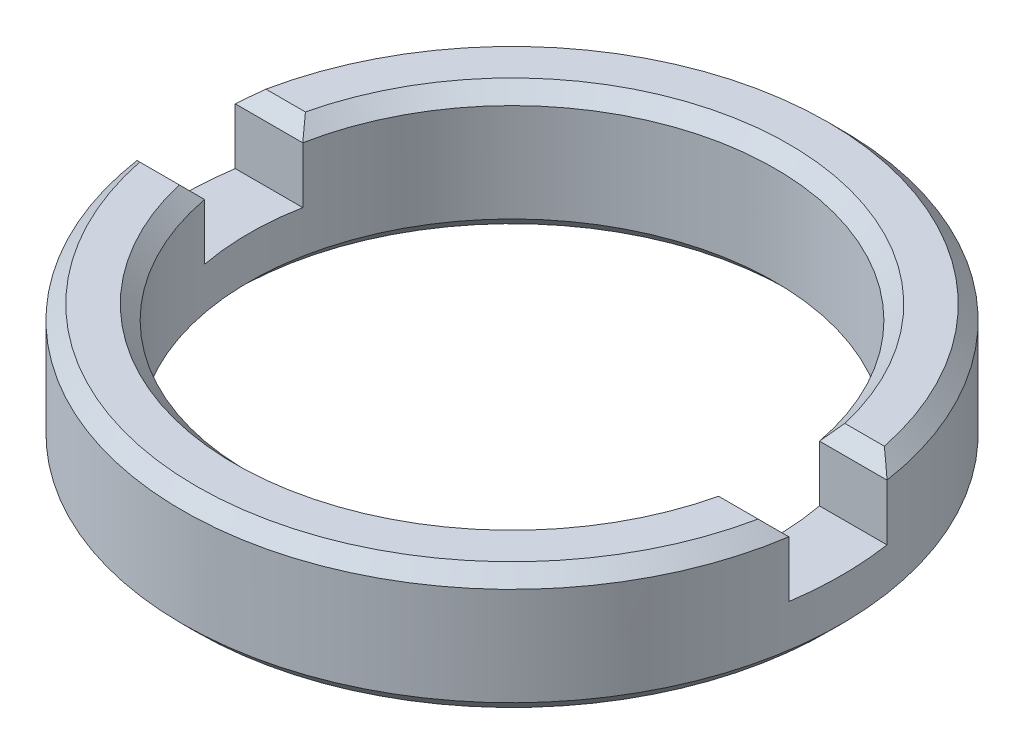
ISO-10303-21;
HEADER;
FILE_DESCRIPTION(('STEP AP214'),'2;1');
FILE_NAME('part.step','',(''),(''),'','','');
FILE_SCHEMA(('AUTOMOTIVE_DESIGN { 1 0 10303 214 1 1 1 1 }'));
ENDSEC;
DATA;
#1=APPLICATION_CONTEXT('core data for automotive mechanical design processes');
#2=APPLICATION_PROTOCOL_DEFINITION('international standard','automotive_design',2000,#1);
#3=PRODUCT_CONTEXT('',#1,'mechanical');
#4=PRODUCT('Part','Part','',(#3));
#5=PRODUCT_RELATED_PRODUCT_CATEGORY('part','',(#4));
#6=PRODUCT_DEFINITION_FORMATION('','',#4);
#7=PRODUCT_DEFINITION_CONTEXT('part definition',#1,'design');
#8=PRODUCT_DEFINITION('design','',#6,#7);
#9=PRODUCT_DEFINITION_SHAPE('','',#8);
#10=(LENGTH_UNIT() NAMED_UNIT(*) SI_UNIT(.MILLI.,.METRE.));
#11=(NAMED_UNIT(*) PLANE_ANGLE_UNIT() SI_UNIT($,.RADIAN.));
#12=(NAMED_UNIT(*) SI_UNIT($,.STERADIAN.) SOLID_ANGLE_UNIT());
#13=UNCERTAINTY_MEASURE_WITH_UNIT(LENGTH_MEASURE(1.E-05),#10,'distance_accuracy_value','');
#14=(GEOMETRIC_REPRESENTATION_CONTEXT(3) GLOBAL_UNCERTAINTY_ASSIGNED_CONTEXT((#13)) GLOBAL_UNIT_ASSIGNED_CONTEXT((#10,
#11,#12)) REPRESENTATION_CONTEXT('',''));
#15=CARTESIAN_POINT('',(0.,0.,0.));
#16=DIRECTION('',(0.,0.,1.));
#17=DIRECTION('',(1.,0.,0.));
#18=AXIS2_PLACEMENT_3D('',#15,#16,#17);
#19=CARTESIAN_POINT('',(0.,0.5715,0.));
#20=DIRECTION('',(0.,-1.,0.));
#21=DIRECTION('',(0.,0.,-1.));
#22=AXIS2_PLACEMENT_3D('',#19,#20,#21);
#23=CYLINDRICAL_SURFACE('',#22,2.9845);
#24=CARTESIAN_POINT('',(0.,-0.444499999999997,0.));
#25=DIRECTION('',(0.,1.,0.));
#26=DIRECTION('',(0.,0.,1.));
#27=AXIS2_PLACEMENT_3D('',#24,#25,#26);
#28=CIRCLE('',#27,2.9845);
#29=CARTESIAN_POINT('',(0.,-0.444499999999997,2.9845));
#30=VERTEX_POINT('',#29);
#31=EDGE_CURVE('E168',#30,#30,#28,.T.);
#32=ORIENTED_EDGE('',*,*,#31,.T.);
#33=EDGE_LOOP('',(#32));
#34=FACE_BOUND('',#33,.T.);
#35=DIRECTION('',(0.,1.,0.));
#36=VECTOR('',#35,1.);
#37=CARTESIAN_POINT('',(-2.95121330981005,-0.0635000000000001,-0.4445));
#38=LINE('',#37,#36);
#39=CARTESIAN_POINT('',(-2.95121330981005,-0.0635000000000001,-0.4445));
#40=VERTEX_POINT('',#39);
#41=CARTESIAN_POINT('',(-2.95121330981005,0.444499999999999,-0.4445));
#42=VERTEX_POINT('',#41);
#43=EDGE_CURVE('E137',#40,#42,#38,.T.);
#44=ORIENTED_EDGE('',*,*,#43,.T.);
#45=CARTESIAN_POINT('',(0.,0.444499999999999,0.));
#46=DIRECTION('',(0.,1.,0.));
#47=DIRECTION('',(0.,0.,1.));
#48=AXIS2_PLACEMENT_3D('',#45,#46,#47);
#49=CIRCLE('',#48,2.9845);
#50=CARTESIAN_POINT('',(2.95121330981005,0.444499999999999,-0.4445));
#51=VERTEX_POINT('',#50);
#52=EDGE_CURVE('E166',#42,#51,#49,.F.);
#53=ORIENTED_EDGE('',*,*,#52,.T.);
#54=DIRECTION('',(0.,1.,0.));
#55=VECTOR('',#54,1.);
#56=CARTESIAN_POINT('',(2.95121330981005,-0.0635000000000001,-0.4445));
#57=LINE('',#56,#55);
#58=CARTESIAN_POINT('',(2.95121330981005,-0.0635000000000001,-0.4445));
#59=VERTEX_POINT('',#58);
#60=EDGE_CURVE('E154',#59,#51,#57,.T.);
#61=ORIENTED_EDGE('',*,*,#60,.F.);
#62=CARTESIAN_POINT('',(0.,-0.0635000000000001,0.));
#63=DIRECTION('',(0.,-1.,0.));
#64=DIRECTION('',(0.,0.,-1.));
#65=AXIS2_PLACEMENT_3D('',#62,#63,#64);
#66=CIRCLE('',#65,2.9845);
#67=CARTESIAN_POINT('',(2.95121330981005,-0.0635000000000001,0.4445));
#68=VERTEX_POINT('',#67);
#69=EDGE_CURVE('E139',#59,#68,#66,.T.);
#70=ORIENTED_EDGE('',*,*,#69,.T.);
#71=DIRECTION('',(0.,1.,0.));
#72=VECTOR('',#71,1.);
#73=CARTESIAN_POINT('',(2.95121330981005,-0.0635000000000001,0.4445));
#74=LINE('',#73,#72);
#75=CARTESIAN_POINT('',(2.95121330981005,0.444499999999999,0.4445));
#76=VERTEX_POINT('',#75);
#77=EDGE_CURVE('E163',#68,#76,#74,.T.);
#78=ORIENTED_EDGE('',*,*,#77,.T.);
#79=CARTESIAN_POINT('',(0.,0.444499999999999,0.));
#80=DIRECTION('',(0.,1.,0.));
#81=DIRECTION('',(0.,0.,1.));
#82=AXIS2_PLACEMENT_3D('',#79,#80,#81);
#83=CIRCLE('',#82,2.9845);
#84=CARTESIAN_POINT('',(-2.95121330981005,0.444499999999999,0.4445));
#85=VERTEX_POINT('',#84);
#86=EDGE_CURVE('E136',#76,#85,#83,.F.);
#87=ORIENTED_EDGE('',*,*,#86,.T.);
#88=DIRECTION('',(0.,1.,0.));
#89=VECTOR('',#88,1.);
#90=CARTESIAN_POINT('',(-2.95121330981005,-0.0635000000000001,0.4445));
#91=LINE('',#90,#89);
#92=CARTESIAN_POINT('',(-2.95121330981005,-0.0635000000000001,0.4445));
#93=VERTEX_POINT('',#92);
#94=EDGE_CURVE('E117',#93,#85,#91,.T.);
#95=ORIENTED_EDGE('',*,*,#94,.F.);
#96=CARTESIAN_POINT('',(0.,-0.0635000000000001,0.));
#97=DIRECTION('',(0.,-1.,0.));
#98=DIRECTION('',(0.,0.,-1.));
#99=AXIS2_PLACEMENT_3D('',#96,#97,#98);
#100=CIRCLE('',#99,2.9845);
#101=EDGE_CURVE('E124',#93,#40,#100,.T.);
#102=ORIENTED_EDGE('',*,*,#101,.T.);
#103=EDGE_LOOP('',(#44,#53,#61,#70,#78,#87,#95,#102));
#104=FACE_BOUND('',#103,.T.);
#105=ADVANCED_FACE('F16',(#34,#104),#23,.T.);
#106=CARTESIAN_POINT('',(0.,0.5715,0.));
#107=DIRECTION('',(0.,1.,0.));
#108=DIRECTION('',(0.,0.,1.));
#109=AXIS2_PLACEMENT_3D('',#106,#107,#108);
#110=PLANE('',#109);
#111=DIRECTION('',(-1.,0.,0.));
#112=VECTOR('',#111,1.);
#113=CARTESIAN_POINT('',(0.,0.5715,0.571500000000002));
#114=LINE('',#113,#112);
#115=CARTESIAN_POINT('',(2.79976677600117,0.5715,0.571500000000002));
#116=VERTEX_POINT('',#115);
#117=CARTESIAN_POINT('',(2.44227472093129,0.5715,0.571500000000002));
#118=VERTEX_POINT('',#117);
#119=EDGE_CURVE('E37',#116,#118,#114,.T.);
#120=ORIENTED_EDGE('',*,*,#119,.T.);
#121=CARTESIAN_POINT('',(0.,0.5715,0.));
#122=DIRECTION('',(0.,1.,0.));
#123=DIRECTION('',(0.,0.,1.));
#124=AXIS2_PLACEMENT_3D('',#121,#122,#123);
#125=CIRCLE('',#124,2.50825);
#126=CARTESIAN_POINT('',(-2.44227472093129,0.5715,0.571500000000002));
#127=VERTEX_POINT('',#126);
#128=EDGE_CURVE('E204',#118,#127,#125,.F.);
#129=ORIENTED_EDGE('',*,*,#128,.T.);
#130=DIRECTION('',(-1.,0.,0.));
#131=VECTOR('',#130,1.);
#132=CARTESIAN_POINT('',(0.,0.5715,0.571500000000002));
#133=LINE('',#132,#131);
#134=CARTESIAN_POINT('',(-2.79976677600117,0.5715,0.571500000000002));
#135=VERTEX_POINT('',#134);
#136=EDGE_CURVE('E201',#127,#135,#133,.T.);
#137=ORIENTED_EDGE('',*,*,#136,.T.);
#138=CARTESIAN_POINT('',(0.,0.5715,0.));
#139=DIRECTION('',(0.,1.,0.));
#140=DIRECTION('',(0.,0.,1.));
#141=AXIS2_PLACEMENT_3D('',#138,#139,#140);
#142=CIRCLE('',#141,2.8575);
#143=EDGE_CURVE('E199',#135,#116,#142,.T.);
#144=ORIENTED_EDGE('',*,*,#143,.T.);
#145=EDGE_LOOP('',(#120,#129,#137,#144));
#146=FACE_BOUND('',#145,.T.);
#147=ADVANCED_FACE('F277',(#146),#110,.T.);
#148=DIRECTION('',(1.,0.,0.));
#149=VECTOR('',#148,1.);
#150=CARTESIAN_POINT('',(0.,0.5715,-0.571500000000002));
#151=LINE('',#150,#149);
#152=CARTESIAN_POINT('',(-2.79976677600117,0.5715,-0.571500000000002));
#153=VERTEX_POINT('',#152);
#154=CARTESIAN_POINT('',(-2.44227472093129,0.5715,-0.571500000000002));
#155=VERTEX_POINT('',#154);
#156=EDGE_CURVE('E188',#153,#155,#151,.T.);
#157=ORIENTED_EDGE('',*,*,#156,.T.);
#158=CARTESIAN_POINT('',(0.,0.5715,0.));
#159=DIRECTION('',(0.,1.,0.));
#160=DIRECTION('',(0.,0.,1.));
#161=AXIS2_PLACEMENT_3D('',#158,#159,#160);
#162=CIRCLE('',#161,2.50825);
#163=CARTESIAN_POINT('',(2.44227472093129,0.5715,-0.571500000000002));
#164=VERTEX_POINT('',#163);
#165=EDGE_CURVE('E192',#155,#164,#162,.F.);
#166=ORIENTED_EDGE('',*,*,#165,.T.);
#167=DIRECTION('',(1.,0.,0.));
#168=VECTOR('',#167,1.);
#169=CARTESIAN_POINT('',(0.,0.5715,-0.571500000000002));
#170=LINE('',#169,#168);
#171=CARTESIAN_POINT('',(2.79976677600117,0.5715,-0.571500000000002));
#172=VERTEX_POINT('',#171);
#173=EDGE_CURVE('E190',#164,#172,#170,.T.);
#174=ORIENTED_EDGE('',*,*,#173,.T.);
#175=CARTESIAN_POINT('',(0.,0.5715,0.));
#176=DIRECTION('',(0.,1.,0.));
#177=DIRECTION('',(0.,0.,1.));
#178=AXIS2_PLACEMENT_3D('',#175,#176,#177);
#179=CIRCLE('',#178,2.8575);
#180=EDGE_CURVE('E186',#172,#153,#179,.T.);
#181=ORIENTED_EDGE('',*,*,#180,.T.);
#182=EDGE_LOOP('',(#157,#166,#174,#181));
#183=FACE_BOUND('',#182,.T.);
#184=ADVANCED_FACE('F283',(#183),#110,.T.);
#185=CARTESIAN_POINT('',(0.,0.5715,0.));
#186=DIRECTION('',(0.,-1.,0.));
#187=DIRECTION('',(0.,0.,-1.));
#188=AXIS2_PLACEMENT_3D('',#185,#186,#187);
#189=CYLINDRICAL_SURFACE('',#188,2.38125);
#190=CARTESIAN_POINT('',(0.,-0.444499999999999,0.));
#191=DIRECTION('',(0.,1.,0.));
#192=DIRECTION('',(0.,0.,1.));
#193=AXIS2_PLACEMENT_3D('',#190,#191,#192);
#194=CIRCLE('',#193,2.38125);
#195=CARTESIAN_POINT('',(0.,-0.444499999999999,2.38125));
#196=VERTEX_POINT('',#195);
#197=EDGE_CURVE('E183',#196,#196,#194,.F.);
#198=ORIENTED_EDGE('',*,*,#197,.T.);
#199=EDGE_LOOP('',(#198));
#200=FACE_BOUND('',#199,.T.);
#201=DIRECTION('',(0.,1.,0.));
#202=VECTOR('',#201,1.);
#203=CARTESIAN_POINT('',(2.33939550151316,-0.0635000000000001,-0.4445));
#204=LINE('',#203,#202);
#205=CARTESIAN_POINT('',(2.33939550151316,-0.0635000000000001,-0.4445));
#206=VERTEX_POINT('',#205);
#207=CARTESIAN_POINT('',(2.33939550151316,0.444499999999999,-0.4445));
#208=VERTEX_POINT('',#207);
#209=EDGE_CURVE('E157',#206,#208,#204,.T.);
#210=ORIENTED_EDGE('',*,*,#209,.T.);
#211=CARTESIAN_POINT('',(0.,0.444499999999999,0.));
#212=DIRECTION('',(0.,1.,0.));
#213=DIRECTION('',(0.,0.,1.));
#214=AXIS2_PLACEMENT_3D('',#211,#212,#213);
#215=CIRCLE('',#214,2.38125);
#216=CARTESIAN_POINT('',(-2.33939550151316,0.444499999999999,-0.4445));
#217=VERTEX_POINT('',#216);
#218=EDGE_CURVE('E180',#208,#217,#215,.T.);
#219=ORIENTED_EDGE('',*,*,#218,.T.);
#220=DIRECTION('',(0.,1.,0.));
#221=VECTOR('',#220,1.);
#222=CARTESIAN_POINT('',(-2.33939550151316,-0.0635000000000001,-0.4445));
#223=LINE('',#222,#221);
#224=CARTESIAN_POINT('',(-2.33939550151316,-0.0635000000000001,-0.4445));
#225=VERTEX_POINT('',#224);
#226=EDGE_CURVE('E141',#225,#217,#223,.T.);
#227=ORIENTED_EDGE('',*,*,#226,.F.);
#228=CARTESIAN_POINT('',(0.,-0.0635000000000001,0.));
#229=DIRECTION('',(0.,1.,0.));
#230=DIRECTION('',(0.,0.,-1.));
#231=AXIS2_PLACEMENT_3D('',#228,#229,#230);
#232=CIRCLE('',#231,2.38125);
#233=CARTESIAN_POINT('',(-2.33939550151316,-0.0635000000000001,0.4445));
#234=VERTEX_POINT('',#233);
#235=EDGE_CURVE('E125',#225,#234,#232,.T.);
#236=ORIENTED_EDGE('',*,*,#235,.T.);
#237=DIRECTION('',(0.,1.,0.));
#238=VECTOR('',#237,1.);
#239=CARTESIAN_POINT('',(-2.33939550151316,-0.0635000000000001,0.4445));
#240=LINE('',#239,#238);
#241=CARTESIAN_POINT('',(-2.33939550151316,0.444499999999999,0.4445));
#242=VERTEX_POINT('',#241);
#243=EDGE_CURVE('E120',#234,#242,#240,.T.);
#244=ORIENTED_EDGE('',*,*,#243,.T.);
#245=CARTESIAN_POINT('',(0.,0.444499999999999,0.));
#246=DIRECTION('',(0.,1.,0.));
#247=DIRECTION('',(0.,0.,1.));
#248=AXIS2_PLACEMENT_3D('',#245,#246,#247);
#249=CIRCLE('',#248,2.38125);
#250=CARTESIAN_POINT('',(2.33939550151316,0.444499999999999,0.4445));
#251=VERTEX_POINT('',#250);
#252=EDGE_CURVE('E177',#242,#251,#249,.T.);
#253=ORIENTED_EDGE('',*,*,#252,.T.);
#254=DIRECTION('',(0.,1.,0.));
#255=VECTOR('',#254,1.);
#256=CARTESIAN_POINT('',(2.33939550151316,-0.0635000000000001,0.4445));
#257=LINE('',#256,#255);
#258=CARTESIAN_POINT('',(2.33939550151316,-0.0635000000000001,0.4445));
#259=VERTEX_POINT('',#258);
#260=EDGE_CURVE('E160',#259,#251,#257,.T.);
#261=ORIENTED_EDGE('',*,*,#260,.F.);
#262=CARTESIAN_POINT('',(0.,-0.0635000000000001,0.));
#263=DIRECTION('',(0.,1.,0.));
#264=DIRECTION('',(0.,0.,-1.));
#265=AXIS2_PLACEMENT_3D('',#262,#263,#264);
#266=CIRCLE('',#265,2.38125);
#267=EDGE_CURVE('E149',#259,#206,#266,.T.);
#268=ORIENTED_EDGE('',*,*,#267,.T.);
#269=EDGE_LOOP('',(#210,#219,#227,#236,#244,#253,#261,#268));
#270=FACE_BOUND('',#269,.T.);
#271=ADVANCED_FACE('F302',(#200,#270),#189,.F.);
#272=CARTESIAN_POINT('',(0.,-0.5715,0.));
#273=DIRECTION('',(0.,1.,0.));
#274=DIRECTION('',(0.,0.,1.));
#275=AXIS2_PLACEMENT_3D('',#272,#273,#274);
#276=PLANE('',#275);
#277=CARTESIAN_POINT('',(0.,-0.5715,0.));
#278=DIRECTION('',(0.,1.,0.));
#279=DIRECTION('',(0.,0.,1.));
#280=AXIS2_PLACEMENT_3D('',#277,#278,#279);
#281=CIRCLE('',#280,2.8575);
#282=CARTESIAN_POINT('',(0.,-0.5715,2.8575));
#283=VERTEX_POINT('',#282);
#284=EDGE_CURVE('E174',#283,#283,#281,.F.);
#285=ORIENTED_EDGE('',*,*,#284,.T.);
#286=EDGE_LOOP('',(#285));
#287=FACE_BOUND('',#286,.T.);
#288=CARTESIAN_POINT('',(0.,-0.5715,0.));
#289=DIRECTION('',(0.,1.,0.));
#290=DIRECTION('',(0.,0.,1.));
#291=AXIS2_PLACEMENT_3D('',#288,#289,#290);
#292=CIRCLE('',#291,2.50825);
#293=CARTESIAN_POINT('',(0.,-0.5715,2.50825));
#294=VERTEX_POINT('',#293);
#295=EDGE_CURVE('E171',#294,#294,#292,.T.);
#296=ORIENTED_EDGE('',*,*,#295,.T.);
#297=EDGE_LOOP('',(#296));
#298=FACE_BOUND('',#297,.T.);
#299=ADVANCED_FACE('F287',(#287,#298),#276,.F.);
#300=CARTESIAN_POINT('',(2.33939550151316,-0.0635000000000001,0.4445));
#301=DIRECTION('',(0.,0.,-1.));
#302=DIRECTION('',(-1.,0.,0.));
#303=AXIS2_PLACEMENT_3D('',#300,#301,#302);
#304=PLANE('',#303);
#305=ORIENTED_EDGE('',*,*,#260,.T.);
#306=DIRECTION('',(1.,0.,0.));
#307=VECTOR('',#306,1.);
#308=CARTESIAN_POINT('',(2.33939550151316,0.444499999999999,0.4445));
#309=LINE('',#308,#307);
#310=EDGE_CURVE('E29',#251,#76,#309,.T.);
#311=ORIENTED_EDGE('',*,*,#310,.T.);
#312=ORIENTED_EDGE('',*,*,#77,.F.);
#313=DIRECTION('',(-1.,0.,0.));
#314=VECTOR('',#313,1.);
#315=CARTESIAN_POINT('',(2.33939550151316,-0.0635000000000001,0.4445));
#316=LINE('',#315,#314);
#317=EDGE_CURVE('E147',#68,#259,#316,.T.);
#318=ORIENTED_EDGE('',*,*,#317,.T.);
#319=EDGE_LOOP('',(#305,#311,#312,#318));
#320=FACE_BOUND('',#319,.T.);
#321=ADVANCED_FACE('F347',(#320),#304,.T.);
#322=CARTESIAN_POINT('',(2.33939550151316,-0.0635000000000001,-0.4445));
#323=DIRECTION('',(0.,0.,1.));
#324=DIRECTION('',(1.,0.,0.));
#325=AXIS2_PLACEMENT_3D('',#322,#323,#324);
#326=PLANE('',#325);
#327=ORIENTED_EDGE('',*,*,#60,.T.);
#328=DIRECTION('',(-1.,0.,0.));
#329=VECTOR('',#328,1.);
#330=CARTESIAN_POINT('',(2.33939550151316,0.444499999999999,-0.4445));
#331=LINE('',#330,#329);
#332=EDGE_CURVE('E195',#51,#208,#331,.T.);
#333=ORIENTED_EDGE('',*,*,#332,.T.);
#334=ORIENTED_EDGE('',*,*,#209,.F.);
#335=DIRECTION('',(1.,0.,0.));
#336=VECTOR('',#335,1.);
#337=CARTESIAN_POINT('',(2.33939550151316,-0.0635000000000001,-0.4445));
#338=LINE('',#337,#336);
#339=EDGE_CURVE('E152',#206,#59,#338,.T.);
#340=ORIENTED_EDGE('',*,*,#339,.T.);
#341=EDGE_LOOP('',(#327,#333,#334,#340));
#342=FACE_BOUND('',#341,.T.);
#343=ADVANCED_FACE('F330',(#342),#326,.T.);
#344=CARTESIAN_POINT('',(0.,-0.0635000000000001,0.));
#345=DIRECTION('',(0.,-1.,0.));
#346=DIRECTION('',(0.,0.,-1.));
#347=AXIS2_PLACEMENT_3D('',#344,#345,#346);
#348=PLANE('',#347);
#349=ORIENTED_EDGE('',*,*,#69,.F.);
#350=ORIENTED_EDGE('',*,*,#339,.F.);
#351=ORIENTED_EDGE('',*,*,#267,.F.);
#352=ORIENTED_EDGE('',*,*,#317,.F.);
#353=EDGE_LOOP('',(#349,#350,#351,#352));
#354=FACE_BOUND('',#353,.T.);
#355=ADVANCED_FACE('F333',(#354),#348,.F.);
#356=CARTESIAN_POINT('',(-2.95121330981005,-0.0635000000000001,0.4445));
#357=DIRECTION('',(0.,0.,-1.));
#358=DIRECTION('',(-1.,0.,0.));
#359=AXIS2_PLACEMENT_3D('',#356,#357,#358);
#360=PLANE('',#359);
#361=ORIENTED_EDGE('',*,*,#94,.T.);
#362=DIRECTION('',(1.,0.,0.));
#363=VECTOR('',#362,1.);
#364=CARTESIAN_POINT('',(-2.95121330981005,0.444499999999999,0.4445));
#365=LINE('',#364,#363);
#366=EDGE_CURVE('E10',#85,#242,#365,.T.);
#367=ORIENTED_EDGE('',*,*,#366,.T.);
#368=ORIENTED_EDGE('',*,*,#243,.F.);
#369=DIRECTION('',(-1.,0.,0.));
#370=VECTOR('',#369,1.);
#371=CARTESIAN_POINT('',(-2.95121330981005,-0.0635000000000001,0.4445));
#372=LINE('',#371,#370);
#373=EDGE_CURVE('E113',#234,#93,#372,.T.);
#374=ORIENTED_EDGE('',*,*,#373,.T.);
#375=EDGE_LOOP('',(#361,#367,#368,#374));
#376=FACE_BOUND('',#375,.T.);
#377=ADVANCED_FACE('F115',(#376),#360,.T.);
#378=CARTESIAN_POINT('',(-2.95121330981005,-0.0635000000000001,-0.4445));
#379=DIRECTION('',(0.,0.,1.));
#380=DIRECTION('',(1.,0.,0.));
#381=AXIS2_PLACEMENT_3D('',#378,#379,#380);
#382=PLANE('',#381);
#383=ORIENTED_EDGE('',*,*,#226,.T.);
#384=DIRECTION('',(-1.,0.,0.));
#385=VECTOR('',#384,1.);
#386=CARTESIAN_POINT('',(-2.95121330981005,0.444499999999999,-0.4445));
#387=LINE('',#386,#385);
#388=EDGE_CURVE('E197',#217,#42,#387,.T.);
#389=ORIENTED_EDGE('',*,*,#388,.T.);
#390=ORIENTED_EDGE('',*,*,#43,.F.);
#391=DIRECTION('',(1.,0.,0.));
#392=VECTOR('',#391,1.);
#393=CARTESIAN_POINT('',(-2.95121330981005,-0.0635000000000001,-0.4445));
#394=LINE('',#393,#392);
#395=EDGE_CURVE('E130',#40,#225,#394,.T.);
#396=ORIENTED_EDGE('',*,*,#395,.T.);
#397=EDGE_LOOP('',(#383,#389,#390,#396));
#398=FACE_BOUND('',#397,.T.);
#399=ADVANCED_FACE('F327',(#398),#382,.T.);
#400=CARTESIAN_POINT('',(0.,-0.0635000000000001,0.));
#401=DIRECTION('',(0.,-1.,0.));
#402=DIRECTION('',(0.,0.,-1.));
#403=AXIS2_PLACEMENT_3D('',#400,#401,#402);
#404=PLANE('',#403);
#405=ORIENTED_EDGE('',*,*,#235,.F.);
#406=ORIENTED_EDGE('',*,*,#395,.F.);
#407=ORIENTED_EDGE('',*,*,#101,.F.);
#408=ORIENTED_EDGE('',*,*,#373,.F.);
#409=EDGE_LOOP('',(#405,#406,#407,#408));
#410=FACE_BOUND('',#409,.T.);
#411=ADVANCED_FACE('F129',(#410),#404,.F.);
#412=CARTESIAN_POINT('',(0.,-0.444499999999997,0.));
#413=DIRECTION('',(0.,1.,0.));
#414=DIRECTION('',(0.,0.,1.));
#415=AXIS2_PLACEMENT_3D('',#412,#413,#414);
#416=CONICAL_SURFACE('',#415,2.9845,0.785398163397442);
#417=ORIENTED_EDGE('',*,*,#284,.F.);
#418=EDGE_LOOP('',(#417));
#419=FACE_BOUND('',#418,.T.);
#420=ORIENTED_EDGE('',*,*,#31,.F.);
#421=EDGE_LOOP('',(#420));
#422=FACE_BOUND('',#421,.T.);
#423=ADVANCED_FACE('F288',(#419,#422),#416,.T.);
#424=CARTESIAN_POINT('',(0.,-0.444499999999999,0.));
#425=DIRECTION('',(0.,-1.,0.));
#426=DIRECTION('',(0.,0.,-1.));
#427=AXIS2_PLACEMENT_3D('',#424,#425,#426);
#428=CONICAL_SURFACE('',#427,2.38125,0.785398163397448);
#429=ORIENTED_EDGE('',*,*,#295,.F.);
#430=EDGE_LOOP('',(#429));
#431=FACE_BOUND('',#430,.T.);
#432=ORIENTED_EDGE('',*,*,#197,.F.);
#433=EDGE_LOOP('',(#432));
#434=FACE_BOUND('',#433,.T.);
#435=ADVANCED_FACE('F290',(#431,#434),#428,.F.);
#436=CARTESIAN_POINT('',(0.,0.5715,0.));
#437=DIRECTION('',(0.,-1.,0.));
#438=DIRECTION('',(0.,0.,-1.));
#439=AXIS2_PLACEMENT_3D('',#436,#437,#438);
#440=CONICAL_SURFACE('',#439,2.8575,0.785398163397452);
#441=CARTESIAN_POINT('',(2.79976677600117,0.5715,-0.571500000000002));
#442=CARTESIAN_POINT('',(2.82539634726213,0.550564931262676,-0.550564931262678));
#443=CARTESIAN_POINT('',(2.85083168875329,0.52951405376534,-0.529514053765341));
#444=CARTESIAN_POINT('',(2.9013138659783,0.487180720007904,-0.487180720007905));
#445=CARTESIAN_POINT('',(2.92636070242343,0.465898264171906,-0.465898264171907));
#446=CARTESIAN_POINT('',(2.95121330981005,0.444499999999999,-0.4445));
#447=B_SPLINE_CURVE_WITH_KNOTS('',3,(#441,#442,#443,#444,#445,#446),.UNSPECIFIED.,.F.,.F.,(4,2,
4),(0.,0.117469652899338,0.23493909070587),.UNSPECIFIED.);
#448=EDGE_CURVE('E244',#51,#172,#447,.F.);
#449=ORIENTED_EDGE('',*,*,#448,.F.);
#450=ORIENTED_EDGE('',*,*,#52,.F.);
#451=CARTESIAN_POINT('',(-2.95121330981005,0.444499999999999,-0.4445));
#452=CARTESIAN_POINT('',(-2.92636070242343,0.465898264171906,-0.465898264171907));
#453=CARTESIAN_POINT('',(-2.9013138659783,0.487180720007904,-0.487180720007905));
#454=CARTESIAN_POINT('',(-2.85083168875329,0.52951405376534,-0.529514053765341));
#455=CARTESIAN_POINT('',(-2.82539634726213,0.550564931262676,-0.550564931262678));
#456=CARTESIAN_POINT('',(-2.79976677600117,0.5715,-0.571500000000002));
#457=B_SPLINE_CURVE_WITH_KNOTS('',3,(#451,#452,#453,#454,#455,#456),.UNSPECIFIED.,.F.,.F.,(4,2,
4),(0.,0.117469437806531,0.23493909070587),.UNSPECIFIED.);
#458=EDGE_CURVE('E238',#153,#42,#457,.F.);
#459=ORIENTED_EDGE('',*,*,#458,.F.);
#460=ORIENTED_EDGE('',*,*,#180,.F.);
#461=EDGE_LOOP('',(#449,#450,#459,#460));
#462=FACE_BOUND('',#461,.T.);
#463=ADVANCED_FACE('F232',(#462),#440,.T.);
#464=CARTESIAN_POINT('',(0.,0.5715,-0.571500000000002));
#465=DIRECTION('',(0.,-0.70710678118655,-0.707106781186545));
#466=DIRECTION('',(1.,0.,0.));
#467=AXIS2_PLACEMENT_3D('',#464,#465,#466);
#468=PLANE('',#467);
#469=ORIENTED_EDGE('',*,*,#458,.T.);
#470=ORIENTED_EDGE('',*,*,#388,.F.);
#471=CARTESIAN_POINT('',(-2.33939550151316,0.444499999999999,-0.4445));
#472=CARTESIAN_POINT('',(-2.3568198030914,0.465554177476995,-0.465554177476996));
#473=CARTESIAN_POINT('',(-2.37410522688191,0.486664605498521,-0.486664605498523));
#474=CARTESIAN_POINT('',(-2.40839829971064,0.528997938957677,-0.528997938957678));
#475=CARTESIAN_POINT('',(-2.42540594905951,0.550220844269484,-0.550220844269485));
#476=CARTESIAN_POINT('',(-2.44227472093129,0.571499999999999,-0.571500000000001));
#477=B_SPLINE_CURVE_WITH_KNOTS('',3,(#471,#472,#473,#474,#475,#476),.UNSPECIFIED.,.F.,.F.,(4,2,
4),(0.,0.103492878803782,0.20698564186042),.UNSPECIFIED.);
#478=EDGE_CURVE('E214',#155,#217,#477,.F.);
#479=ORIENTED_EDGE('',*,*,#478,.F.);
#480=ORIENTED_EDGE('',*,*,#156,.F.);
#481=EDGE_LOOP('',(#469,#470,#479,#480));
#482=FACE_BOUND('',#481,.T.);
#483=ADVANCED_FACE('F227',(#482),#468,.F.);
#484=CARTESIAN_POINT('',(0.,0.5715,-0.571500000000002));
#485=DIRECTION('',(0.,-0.70710678118655,-0.707106781186545));
#486=DIRECTION('',(1.,0.,0.));
#487=AXIS2_PLACEMENT_3D('',#484,#485,#486);
#488=PLANE('',#487);
#489=ORIENTED_EDGE('',*,*,#448,.T.);
#490=ORIENTED_EDGE('',*,*,#173,.F.);
#491=CARTESIAN_POINT('',(2.44227472093129,0.5715,-0.571500000000002));
#492=CARTESIAN_POINT('',(2.42540594905951,0.550220844269484,-0.550220844269486));
#493=CARTESIAN_POINT('',(2.40839829971064,0.528997938957677,-0.528997938957678));
#494=CARTESIAN_POINT('',(2.37410522688191,0.486664605498521,-0.486664605498522));
#495=CARTESIAN_POINT('',(2.3568198030914,0.465554177476994,-0.465554177476995));
#496=CARTESIAN_POINT('',(2.33939550151316,0.444499999999998,-0.444499999999999));
#497=B_SPLINE_CURVE_WITH_KNOTS('',3,(#491,#492,#493,#494,#495,#496),.UNSPECIFIED.,.F.,.F.,(4,2,
4),(0.,0.103492763056639,0.206985641860421),.UNSPECIFIED.);
#498=EDGE_CURVE('E207',#208,#164,#497,.F.);
#499=ORIENTED_EDGE('',*,*,#498,.F.);
#500=ORIENTED_EDGE('',*,*,#332,.F.);
#501=EDGE_LOOP('',(#489,#490,#499,#500));
#502=FACE_BOUND('',#501,.T.);
#503=ADVANCED_FACE('F220',(#502),#488,.F.);
#504=CARTESIAN_POINT('',(0.,0.5715,0.));
#505=DIRECTION('',(0.,1.,0.));
#506=DIRECTION('',(0.,0.,1.));
#507=AXIS2_PLACEMENT_3D('',#504,#505,#506);
#508=CONICAL_SURFACE('',#507,2.50825,0.785398163397452);
#509=ORIENTED_EDGE('',*,*,#478,.T.);
#510=ORIENTED_EDGE('',*,*,#218,.F.);
#511=ORIENTED_EDGE('',*,*,#498,.T.);
#512=ORIENTED_EDGE('',*,*,#165,.F.);
#513=EDGE_LOOP('',(#509,#510,#511,#512));
#514=FACE_BOUND('',#513,.T.);
#515=ADVANCED_FACE('F223',(#514),#508,.F.);
#516=CARTESIAN_POINT('',(0.,0.5715,0.));
#517=DIRECTION('',(0.,-1.,0.));
#518=DIRECTION('',(0.,0.,-1.));
#519=AXIS2_PLACEMENT_3D('',#516,#517,#518);
#520=CONICAL_SURFACE('',#519,2.8575,0.785398163397452);
#521=CARTESIAN_POINT('',(-2.79976677600117,0.5715,0.571500000000002));
#522=CARTESIAN_POINT('',(-2.82539634726213,0.550564931262676,0.550564931262678));
#523=CARTESIAN_POINT('',(-2.85083168875329,0.52951405376534,0.529514053765341));
#524=CARTESIAN_POINT('',(-2.9013138659783,0.487180720007904,0.487180720007905));
#525=CARTESIAN_POINT('',(-2.92636070242343,0.465898264171906,0.465898264171907));
#526=CARTESIAN_POINT('',(-2.95121330981005,0.4445,0.4445));
#527=B_SPLINE_CURVE_WITH_KNOTS('',3,(#521,#522,#523,#524,#525,#526),.UNSPECIFIED.,.F.,.F.,(4,2,
4),(0.,0.117469652899338,0.234939090705869),.UNSPECIFIED.);
#528=EDGE_CURVE('E339',#85,#135,#527,.F.);
#529=ORIENTED_EDGE('',*,*,#528,.F.);
#530=ORIENTED_EDGE('',*,*,#86,.F.);
#531=CARTESIAN_POINT('',(2.95121330981005,0.444499999999999,0.4445));
#532=CARTESIAN_POINT('',(2.92636070242343,0.465898264171906,0.465898264171907));
#533=CARTESIAN_POINT('',(2.9013138659783,0.487180720007904,0.487180720007905));
#534=CARTESIAN_POINT('',(2.85083168875329,0.52951405376534,0.529514053765341));
#535=CARTESIAN_POINT('',(2.82539634726213,0.550564931262676,0.550564931262678));
#536=CARTESIAN_POINT('',(2.79976677600117,0.5715,0.571500000000002));
#537=B_SPLINE_CURVE_WITH_KNOTS('',3,(#531,#532,#533,#534,#535,#536),.UNSPECIFIED.,.F.,.F.,(4,2,
4),(0.,0.117469437806531,0.23493909070587),.UNSPECIFIED.);
#538=EDGE_CURVE('E21',#116,#76,#537,.F.);
#539=ORIENTED_EDGE('',*,*,#538,.F.);
#540=ORIENTED_EDGE('',*,*,#143,.F.);
#541=EDGE_LOOP('',(#529,#530,#539,#540));
#542=FACE_BOUND('',#541,.T.);
#543=ADVANCED_FACE('F18',(#542),#520,.T.);
#544=CARTESIAN_POINT('',(0.,0.5715,0.571500000000002));
#545=DIRECTION('',(0.,-0.70710678118655,0.707106781186545));
#546=DIRECTION('',(-1.,0.,0.));
#547=AXIS2_PLACEMENT_3D('',#544,#545,#546);
#548=PLANE('',#547);
#549=ORIENTED_EDGE('',*,*,#538,.T.);
#550=ORIENTED_EDGE('',*,*,#310,.F.);
#551=CARTESIAN_POINT('',(2.33939550151316,0.444499999999999,0.4445));
#552=CARTESIAN_POINT('',(2.3568198030914,0.465554177476995,0.465554177476996));
#553=CARTESIAN_POINT('',(2.37410522688191,0.486664605498521,0.486664605498523));
#554=CARTESIAN_POINT('',(2.40839829971064,0.528997938957677,0.528997938957678));
#555=CARTESIAN_POINT('',(2.42540594905951,0.550220844269484,0.550220844269485));
#556=CARTESIAN_POINT('',(2.44227472093129,0.571499999999999,0.571500000000001));
#557=B_SPLINE_CURVE_WITH_KNOTS('',3,(#551,#552,#553,#554,#555,#556),.UNSPECIFIED.,.F.,.F.,(4,2,
4),(0.,0.103492878803782,0.20698564186042),.UNSPECIFIED.);
#558=EDGE_CURVE('E253',#118,#251,#557,.F.);
#559=ORIENTED_EDGE('',*,*,#558,.F.);
#560=ORIENTED_EDGE('',*,*,#119,.F.);
#561=EDGE_LOOP('',(#549,#550,#559,#560));
#562=FACE_BOUND('',#561,.T.);
#563=ADVANCED_FACE('F262',(#562),#548,.F.);
#564=CARTESIAN_POINT('',(0.,0.5715,0.571500000000002));
#565=DIRECTION('',(0.,-0.70710678118655,0.707106781186545));
#566=DIRECTION('',(-1.,0.,0.));
#567=AXIS2_PLACEMENT_3D('',#564,#565,#566);
#568=PLANE('',#567);
#569=ORIENTED_EDGE('',*,*,#528,.T.);
#570=ORIENTED_EDGE('',*,*,#136,.F.);
#571=CARTESIAN_POINT('',(-2.44227472093129,0.5715,0.571500000000002));
#572=CARTESIAN_POINT('',(-2.42540594905951,0.550220844269484,0.550220844269486));
#573=CARTESIAN_POINT('',(-2.40839829971064,0.528997938957677,0.528997938957678));
#574=CARTESIAN_POINT('',(-2.37410522688191,0.486664605498521,0.486664605498522));
#575=CARTESIAN_POINT('',(-2.3568198030914,0.465554177476995,0.465554177476996));
#576=CARTESIAN_POINT('',(-2.33939550151316,0.444499999999999,0.4445));
#577=B_SPLINE_CURVE_WITH_KNOTS('',3,(#571,#572,#573,#574,#575,#576),.UNSPECIFIED.,.F.,.F.,(4,2,
4),(0.,0.103492763056639,0.20698564186042),.UNSPECIFIED.);
#578=EDGE_CURVE('E45',#242,#127,#577,.F.);
#579=ORIENTED_EDGE('',*,*,#578,.F.);
#580=ORIENTED_EDGE('',*,*,#366,.F.);
#581=EDGE_LOOP('',(#569,#570,#579,#580));
#582=FACE_BOUND('',#581,.T.);
#583=ADVANCED_FACE('F257',(#582),#568,.F.);
#584=CARTESIAN_POINT('',(0.,0.5715,0.));
#585=DIRECTION('',(0.,1.,0.));
#586=DIRECTION('',(0.,0.,1.));
#587=AXIS2_PLACEMENT_3D('',#584,#585,#586);
#588=CONICAL_SURFACE('',#587,2.50825,0.785398163397452);
#589=ORIENTED_EDGE('',*,*,#558,.T.);
#590=ORIENTED_EDGE('',*,*,#252,.F.);
#591=ORIENTED_EDGE('',*,*,#578,.T.);
#592=ORIENTED_EDGE('',*,*,#128,.F.);
#593=EDGE_LOOP('',(#589,#590,#591,#592));
#594=FACE_BOUND('',#593,.T.);
#595=ADVANCED_FACE('F259',(#594),#588,.F.);
#596=CLOSED_SHELL('',(#105,#147,#184,#271,#299,#321,#343,#355,#377,#399,#411,#423,#435,#463,
#483,#503,#515,#543,#563,#583,#595));
#597=MANIFOLD_SOLID_BREP('B1',#596);
#598=ADVANCED_BREP_SHAPE_REPRESENTATION('',(#18,#597),#14);
#599=SHAPE_DEFINITION_REPRESENTATION(#9,#598);
ENDSEC;
END-ISO-10303-21;
